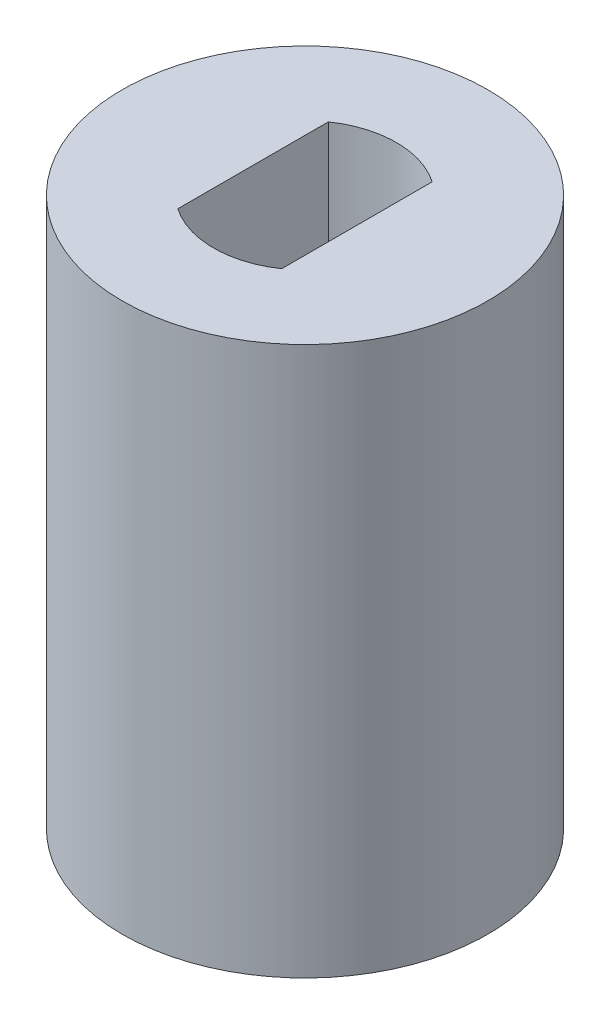
ISO-10303-21;
HEADER;
FILE_DESCRIPTION(('STEP AP214'),'2;1');
FILE_NAME('part.step','',(''),(''),'','','');
FILE_SCHEMA(('AUTOMOTIVE_DESIGN { 1 0 10303 214 1 1 1 1 }'));
ENDSEC;
DATA;
#1=APPLICATION_CONTEXT('core data for automotive mechanical design processes');
#2=APPLICATION_PROTOCOL_DEFINITION('international standard','automotive_design',2000,#1);
#3=PRODUCT_CONTEXT('',#1,'mechanical');
#4=PRODUCT('Part','Part','',(#3));
#5=PRODUCT_RELATED_PRODUCT_CATEGORY('part','',(#4));
#6=PRODUCT_DEFINITION_FORMATION('','',#4);
#7=PRODUCT_DEFINITION_CONTEXT('part definition',#1,'design');
#8=PRODUCT_DEFINITION('design','',#6,#7);
#9=PRODUCT_DEFINITION_SHAPE('','',#8);
#10=(LENGTH_UNIT() NAMED_UNIT(*) SI_UNIT(.MILLI.,.METRE.));
#11=(NAMED_UNIT(*) PLANE_ANGLE_UNIT() SI_UNIT($,.RADIAN.));
#12=(NAMED_UNIT(*) SI_UNIT($,.STERADIAN.) SOLID_ANGLE_UNIT());
#13=UNCERTAINTY_MEASURE_WITH_UNIT(LENGTH_MEASURE(1.E-05),#10,'distance_accuracy_value','');
#14=(GEOMETRIC_REPRESENTATION_CONTEXT(3) GLOBAL_UNCERTAINTY_ASSIGNED_CONTEXT((#13)) GLOBAL_UNIT_ASSIGNED_CONTEXT((#10,
#11,#12)) REPRESENTATION_CONTEXT('',''));
#15=CARTESIAN_POINT('',(0.,0.,0.));
#16=DIRECTION('',(0.,0.,1.));
#17=DIRECTION('',(1.,0.,0.));
#18=AXIS2_PLACEMENT_3D('',#15,#16,#17);
#19=CARTESIAN_POINT('',(0.,15.,0.));
#20=DIRECTION('',(0.,1.,0.));
#21=DIRECTION('',(0.,0.,1.));
#22=AXIS2_PLACEMENT_3D('',#19,#20,#21);
#23=PLANE('',#22);
#24=CARTESIAN_POINT('',(0.,15.,0.));
#25=DIRECTION('',(0.,1.,0.));
#26=DIRECTION('',(0.,0.,1.));
#27=AXIS2_PLACEMENT_3D('',#24,#25,#26);
#28=CIRCLE('',#27,5.);
#29=CARTESIAN_POINT('',(0.,15.,5.));
#30=VERTEX_POINT('',#29);
#31=EDGE_CURVE('E12',#30,#30,#28,.T.);
#32=ORIENTED_EDGE('',*,*,#31,.T.);
#33=EDGE_LOOP('',(#32));
#34=FACE_BOUND('',#33,.T.);
#35=DIRECTION('',(0.,0.,1.));
#36=VECTOR('',#35,1.);
#37=CARTESIAN_POINT('',(-1.42,15.,-2.05757138393787));
#38=LINE('',#37,#36);
#39=CARTESIAN_POINT('',(-1.42,15.,-2.05757138393787));
#40=VERTEX_POINT('',#39);
#41=CARTESIAN_POINT('',(-1.42,15.,2.05757138393787));
#42=VERTEX_POINT('',#41);
#43=EDGE_CURVE('E109',#40,#42,#38,.T.);
#44=ORIENTED_EDGE('',*,*,#43,.F.);
#45=CARTESIAN_POINT('',(0.,15.,0.));
#46=DIRECTION('',(0.,1.,0.));
#47=DIRECTION('',(0.,0.,1.));
#48=AXIS2_PLACEMENT_3D('',#45,#46,#47);
#49=CIRCLE('',#48,2.5);
#50=CARTESIAN_POINT('',(1.42,15.,-2.05757138393787));
#51=VERTEX_POINT('',#50);
#52=EDGE_CURVE('E100',#51,#40,#49,.T.);
#53=ORIENTED_EDGE('',*,*,#52,.F.);
#54=DIRECTION('',(0.,0.,1.));
#55=VECTOR('',#54,1.);
#56=CARTESIAN_POINT('',(1.42,15.,-2.05757138393787));
#57=LINE('',#56,#55);
#58=CARTESIAN_POINT('',(1.42,15.,2.05757138393787));
#59=VERTEX_POINT('',#58);
#60=EDGE_CURVE('E125',#51,#59,#57,.T.);
#61=ORIENTED_EDGE('',*,*,#60,.T.);
#62=CARTESIAN_POINT('',(0.,15.,0.));
#63=DIRECTION('',(0.,1.,0.));
#64=DIRECTION('',(0.,0.,1.));
#65=AXIS2_PLACEMENT_3D('',#62,#63,#64);
#66=CIRCLE('',#65,2.5);
#67=EDGE_CURVE('E121',#42,#59,#66,.T.);
#68=ORIENTED_EDGE('',*,*,#67,.F.);
#69=EDGE_LOOP('',(#44,#53,#61,#68));
#70=FACE_BOUND('',#69,.T.);
#71=ADVANCED_FACE('F58',(#34,#70),#23,.T.);
#72=CARTESIAN_POINT('',(0.,0.,0.));
#73=DIRECTION('',(0.,1.,0.));
#74=DIRECTION('',(0.,0.,1.));
#75=AXIS2_PLACEMENT_3D('',#72,#73,#74);
#76=PLANE('',#75);
#77=CARTESIAN_POINT('',(0.,0.,0.));
#78=DIRECTION('',(0.,1.,0.));
#79=DIRECTION('',(0.,0.,1.));
#80=AXIS2_PLACEMENT_3D('',#77,#78,#79);
#81=CIRCLE('',#80,5.);
#82=CARTESIAN_POINT('',(0.,0.,5.));
#83=VERTEX_POINT('',#82);
#84=EDGE_CURVE('E62',#83,#83,#81,.T.);
#85=ORIENTED_EDGE('',*,*,#84,.F.);
#86=EDGE_LOOP('',(#85));
#87=FACE_BOUND('',#86,.T.);
#88=CARTESIAN_POINT('',(0.,0.,0.));
#89=DIRECTION('',(0.,1.,0.));
#90=DIRECTION('',(0.,0.,1.));
#91=AXIS2_PLACEMENT_3D('',#88,#89,#90);
#92=CIRCLE('',#91,2.5);
#93=CARTESIAN_POINT('',(1.42,0.,-2.05757138393787));
#94=VERTEX_POINT('',#93);
#95=CARTESIAN_POINT('',(-1.42,0.,-2.05757138393787));
#96=VERTEX_POINT('',#95);
#97=EDGE_CURVE('E82',#94,#96,#92,.T.);
#98=ORIENTED_EDGE('',*,*,#97,.T.);
#99=DIRECTION('',(0.,0.,1.));
#100=VECTOR('',#99,1.);
#101=CARTESIAN_POINT('',(-1.42,0.,-2.05757138393787));
#102=LINE('',#101,#100);
#103=CARTESIAN_POINT('',(-1.42,0.,2.05757138393787));
#104=VERTEX_POINT('',#103);
#105=EDGE_CURVE('E116',#96,#104,#102,.T.);
#106=ORIENTED_EDGE('',*,*,#105,.T.);
#107=CARTESIAN_POINT('',(0.,0.,0.));
#108=DIRECTION('',(0.,1.,0.));
#109=DIRECTION('',(0.,0.,1.));
#110=AXIS2_PLACEMENT_3D('',#107,#108,#109);
#111=CIRCLE('',#110,2.5);
#112=CARTESIAN_POINT('',(1.42,0.,2.05757138393787));
#113=VERTEX_POINT('',#112);
#114=EDGE_CURVE('E134',#104,#113,#111,.T.);
#115=ORIENTED_EDGE('',*,*,#114,.T.);
#116=DIRECTION('',(0.,0.,1.));
#117=VECTOR('',#116,1.);
#118=CARTESIAN_POINT('',(1.42,0.,-2.05757138393787));
#119=LINE('',#118,#117);
#120=EDGE_CURVE('E110',#94,#113,#119,.T.);
#121=ORIENTED_EDGE('',*,*,#120,.F.);
#122=EDGE_LOOP('',(#98,#106,#115,#121));
#123=FACE_BOUND('',#122,.T.);
#124=ADVANCED_FACE('F150',(#87,#123),#76,.F.);
#125=CARTESIAN_POINT('',(0.,15.,0.));
#126=DIRECTION('',(0.,-1.,0.));
#127=DIRECTION('',(0.,0.,-1.));
#128=AXIS2_PLACEMENT_3D('',#125,#126,#127);
#129=CYLINDRICAL_SURFACE('',#128,5.);
#130=ORIENTED_EDGE('',*,*,#31,.F.);
#131=EDGE_LOOP('',(#130));
#132=FACE_BOUND('',#131,.T.);
#133=ORIENTED_EDGE('',*,*,#84,.T.);
#134=EDGE_LOOP('',(#133));
#135=FACE_BOUND('',#134,.T.);
#136=ADVANCED_FACE('F60',(#132,#135),#129,.T.);
#137=CARTESIAN_POINT('',(0.,15.,0.));
#138=DIRECTION('',(0.,-1.,0.));
#139=DIRECTION('',(0.,0.,-1.));
#140=AXIS2_PLACEMENT_3D('',#137,#138,#139);
#141=CYLINDRICAL_SURFACE('',#140,2.5);
#142=ORIENTED_EDGE('',*,*,#97,.F.);
#143=DIRECTION('',(0.,-1.,0.));
#144=VECTOR('',#143,1.);
#145=CARTESIAN_POINT('',(1.42,15.,-2.05757138393787));
#146=LINE('',#145,#144);
#147=EDGE_CURVE('E104',#51,#94,#146,.T.);
#148=ORIENTED_EDGE('',*,*,#147,.F.);
#149=ORIENTED_EDGE('',*,*,#52,.T.);
#150=DIRECTION('',(0.,-1.,0.));
#151=VECTOR('',#150,1.);
#152=CARTESIAN_POINT('',(-1.42,15.,-2.05757138393787));
#153=LINE('',#152,#151);
#154=EDGE_CURVE('E103',#40,#96,#153,.T.);
#155=ORIENTED_EDGE('',*,*,#154,.T.);
#156=EDGE_LOOP('',(#142,#148,#149,#155));
#157=FACE_BOUND('',#156,.T.);
#158=ADVANCED_FACE('F102',(#157),#141,.F.);
#159=CARTESIAN_POINT('',(-1.42,15.,-2.05757138393787));
#160=DIRECTION('',(1.,0.,0.));
#161=DIRECTION('',(0.,0.,-1.));
#162=AXIS2_PLACEMENT_3D('',#159,#160,#161);
#163=PLANE('',#162);
#164=ORIENTED_EDGE('',*,*,#105,.F.);
#165=ORIENTED_EDGE('',*,*,#154,.F.);
#166=ORIENTED_EDGE('',*,*,#43,.T.);
#167=DIRECTION('',(0.,-1.,0.));
#168=VECTOR('',#167,1.);
#169=CARTESIAN_POINT('',(-1.42,15.,2.05757138393787));
#170=LINE('',#169,#168);
#171=EDGE_CURVE('E118',#42,#104,#170,.T.);
#172=ORIENTED_EDGE('',*,*,#171,.T.);
#173=EDGE_LOOP('',(#164,#165,#166,#172));
#174=FACE_BOUND('',#173,.T.);
#175=ADVANCED_FACE('F113',(#174),#163,.T.);
#176=CARTESIAN_POINT('',(0.,15.,0.));
#177=DIRECTION('',(0.,-1.,0.));
#178=DIRECTION('',(0.,0.,-1.));
#179=AXIS2_PLACEMENT_3D('',#176,#177,#178);
#180=CYLINDRICAL_SURFACE('',#179,2.5);
#181=ORIENTED_EDGE('',*,*,#114,.F.);
#182=ORIENTED_EDGE('',*,*,#171,.F.);
#183=ORIENTED_EDGE('',*,*,#67,.T.);
#184=DIRECTION('',(0.,-1.,0.));
#185=VECTOR('',#184,1.);
#186=CARTESIAN_POINT('',(1.42,15.,2.05757138393787));
#187=LINE('',#186,#185);
#188=EDGE_CURVE('E74',#59,#113,#187,.T.);
#189=ORIENTED_EDGE('',*,*,#188,.T.);
#190=EDGE_LOOP('',(#181,#182,#183,#189));
#191=FACE_BOUND('',#190,.T.);
#192=ADVANCED_FACE('F147',(#191),#180,.F.);
#193=CARTESIAN_POINT('',(1.42,15.,-2.05757138393787));
#194=DIRECTION('',(1.,0.,0.));
#195=DIRECTION('',(0.,0.,-1.));
#196=AXIS2_PLACEMENT_3D('',#193,#194,#195);
#197=PLANE('',#196);
#198=ORIENTED_EDGE('',*,*,#120,.T.);
#199=ORIENTED_EDGE('',*,*,#188,.F.);
#200=ORIENTED_EDGE('',*,*,#60,.F.);
#201=ORIENTED_EDGE('',*,*,#147,.T.);
#202=EDGE_LOOP('',(#198,#199,#200,#201));
#203=FACE_BOUND('',#202,.T.);
#204=ADVANCED_FACE('F151',(#203),#197,.F.);
#205=CLOSED_SHELL('',(#71,#124,#136,#158,#175,#192,#204));
#206=MANIFOLD_SOLID_BREP('B2',#205);
#207=ADVANCED_BREP_SHAPE_REPRESENTATION('',(#18,#206),#14);
#208=SHAPE_DEFINITION_REPRESENTATION(#9,#207);
ENDSEC;
END-ISO-10303-21;
